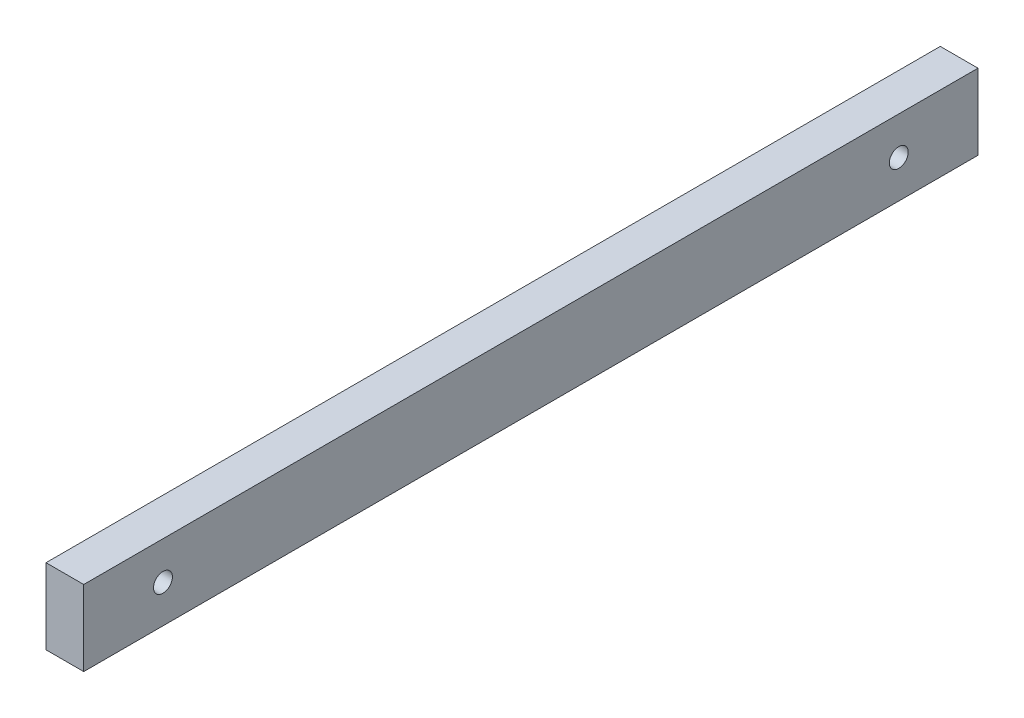
ISO-10303-21;
HEADER;
FILE_DESCRIPTION(('STEP AP214'),'2;1');
FILE_NAME('part.step','',(''),(''),'','','');
FILE_SCHEMA(('AUTOMOTIVE_DESIGN { 1 0 10303 214 1 1 1 1 }'));
ENDSEC;
DATA;
#1=APPLICATION_CONTEXT('core data for automotive mechanical design processes');
#2=APPLICATION_PROTOCOL_DEFINITION('international standard','automotive_design',2000,#1);
#3=PRODUCT_CONTEXT('',#1,'mechanical');
#4=PRODUCT('Part','Part','',(#3));
#5=PRODUCT_RELATED_PRODUCT_CATEGORY('part','',(#4));
#6=PRODUCT_DEFINITION_FORMATION('','',#4);
#7=PRODUCT_DEFINITION_CONTEXT('part definition',#1,'design');
#8=PRODUCT_DEFINITION('design','',#6,#7);
#9=PRODUCT_DEFINITION_SHAPE('','',#8);
#10=(LENGTH_UNIT() NAMED_UNIT(*) SI_UNIT(.MILLI.,.METRE.));
#11=(NAMED_UNIT(*) PLANE_ANGLE_UNIT() SI_UNIT($,.RADIAN.));
#12=(NAMED_UNIT(*) SI_UNIT($,.STERADIAN.) SOLID_ANGLE_UNIT());
#13=UNCERTAINTY_MEASURE_WITH_UNIT(LENGTH_MEASURE(1.E-05),#10,'distance_accuracy_value','');
#14=(GEOMETRIC_REPRESENTATION_CONTEXT(3) GLOBAL_UNCERTAINTY_ASSIGNED_CONTEXT((#13)) GLOBAL_UNIT_ASSIGNED_CONTEXT((#10,
#11,#12)) REPRESENTATION_CONTEXT('',''));
#15=CARTESIAN_POINT('',(0.,0.,0.));
#16=DIRECTION('',(0.,0.,1.));
#17=DIRECTION('',(1.,0.,0.));
#18=AXIS2_PLACEMENT_3D('',#15,#16,#17);
#19=CARTESIAN_POINT('',(4.99999999999999,20.,-118.5));
#20=DIRECTION('',(-1.,0.,0.));
#21=DIRECTION('',(0.,0.,1.));
#22=AXIS2_PLACEMENT_3D('',#19,#20,#21);
#23=PLANE('',#22);
#24=CARTESIAN_POINT('',(4.99999999999999,10.0000000000001,-97.5));
#25=DIRECTION('',(1.,0.,0.));
#26=DIRECTION('',(0.,0.,-1.));
#27=AXIS2_PLACEMENT_3D('',#24,#25,#26);
#28=CIRCLE('',#27,2.49999999999999);
#29=CARTESIAN_POINT('',(4.99999999999999,10.0000000000001,-100.));
#30=VERTEX_POINT('',#29);
#31=EDGE_CURVE('E116',#30,#30,#28,.T.);
#32=ORIENTED_EDGE('',*,*,#31,.F.);
#33=EDGE_LOOP('',(#32));
#34=FACE_BOUND('',#33,.T.);
#35=CARTESIAN_POINT('',(5.00000000000001,10.,97.5));
#36=DIRECTION('',(1.,0.,0.));
#37=DIRECTION('',(0.,0.,-1.));
#38=AXIS2_PLACEMENT_3D('',#35,#36,#37);
#39=CIRCLE('',#38,2.49999999999999);
#40=CARTESIAN_POINT('',(5.00000000000001,10.,95.));
#41=VERTEX_POINT('',#40);
#42=EDGE_CURVE('E110',#41,#41,#39,.T.);
#43=ORIENTED_EDGE('',*,*,#42,.F.);
#44=EDGE_LOOP('',(#43));
#45=FACE_BOUND('',#44,.T.);
#46=DIRECTION('',(0.,0.,-1.));
#47=VECTOR('',#46,1.);
#48=CARTESIAN_POINT('',(4.99999999999999,0.,-118.5));
#49=LINE('',#48,#47);
#50=CARTESIAN_POINT('',(5.00000000000001,0.,118.5));
#51=VERTEX_POINT('',#50);
#52=CARTESIAN_POINT('',(4.99999999999999,0.,-118.5));
#53=VERTEX_POINT('',#52);
#54=EDGE_CURVE('E96',#51,#53,#49,.T.);
#55=ORIENTED_EDGE('',*,*,#54,.T.);
#56=DIRECTION('',(0.,-1.,0.));
#57=VECTOR('',#56,1.);
#58=CARTESIAN_POINT('',(4.99999999999999,20.,-118.5));
#59=LINE('',#58,#57);
#60=CARTESIAN_POINT('',(4.99999999999999,20.,-118.5));
#61=VERTEX_POINT('',#60);
#62=EDGE_CURVE('E11',#61,#53,#59,.T.);
#63=ORIENTED_EDGE('',*,*,#62,.F.);
#64=DIRECTION('',(0.,0.,-1.));
#65=VECTOR('',#64,1.);
#66=CARTESIAN_POINT('',(4.99999999999999,20.,-118.5));
#67=LINE('',#66,#65);
#68=CARTESIAN_POINT('',(5.00000000000001,20.,118.5));
#69=VERTEX_POINT('',#68);
#70=EDGE_CURVE('E84',#69,#61,#67,.T.);
#71=ORIENTED_EDGE('',*,*,#70,.F.);
#72=DIRECTION('',(0.,-1.,0.));
#73=VECTOR('',#72,1.);
#74=CARTESIAN_POINT('',(5.00000000000001,20.,118.5));
#75=LINE('',#74,#73);
#76=EDGE_CURVE('E92',#69,#51,#75,.T.);
#77=ORIENTED_EDGE('',*,*,#76,.T.);
#78=EDGE_LOOP('',(#55,#63,#71,#77));
#79=FACE_BOUND('',#78,.T.);
#80=ADVANCED_FACE('F33',(#34,#45,#79),#23,.F.);
#81=CARTESIAN_POINT('',(-5.00000000000002,20.,-118.5));
#82=DIRECTION('',(0.,0.,1.));
#83=DIRECTION('',(1.,0.,0.));
#84=AXIS2_PLACEMENT_3D('',#81,#82,#83);
#85=PLANE('',#84);
#86=DIRECTION('',(-1.,0.,0.));
#87=VECTOR('',#86,1.);
#88=CARTESIAN_POINT('',(-5.00000000000002,0.,-118.5));
#89=LINE('',#88,#87);
#90=CARTESIAN_POINT('',(-5.00000000000002,0.,-118.5));
#91=VERTEX_POINT('',#90);
#92=EDGE_CURVE('E88',#53,#91,#89,.T.);
#93=ORIENTED_EDGE('',*,*,#92,.T.);
#94=DIRECTION('',(0.,-1.,0.));
#95=VECTOR('',#94,1.);
#96=CARTESIAN_POINT('',(-5.00000000000002,20.,-118.5));
#97=LINE('',#96,#95);
#98=CARTESIAN_POINT('',(-5.00000000000002,20.,-118.5));
#99=VERTEX_POINT('',#98);
#100=EDGE_CURVE('E41',#99,#91,#97,.T.);
#101=ORIENTED_EDGE('',*,*,#100,.F.);
#102=DIRECTION('',(-1.,0.,0.));
#103=VECTOR('',#102,1.);
#104=CARTESIAN_POINT('',(-5.00000000000002,20.,-118.5));
#105=LINE('',#104,#103);
#106=EDGE_CURVE('E79',#61,#99,#105,.T.);
#107=ORIENTED_EDGE('',*,*,#106,.F.);
#108=ORIENTED_EDGE('',*,*,#62,.T.);
#109=EDGE_LOOP('',(#93,#101,#107,#108));
#110=FACE_BOUND('',#109,.T.);
#111=ADVANCED_FACE('F87',(#110),#85,.F.);
#112=CARTESIAN_POINT('',(-5.00000000000002,20.,-118.5));
#113=DIRECTION('',(1.,0.,0.));
#114=DIRECTION('',(0.,0.,-1.));
#115=AXIS2_PLACEMENT_3D('',#112,#113,#114);
#116=PLANE('',#115);
#117=CARTESIAN_POINT('',(-5.00000000000001,10.0000000000001,-97.5));
#118=DIRECTION('',(1.,0.,0.));
#119=DIRECTION('',(0.,0.,-1.));
#120=AXIS2_PLACEMENT_3D('',#117,#118,#119);
#121=CIRCLE('',#120,2.49999999999999);
#122=CARTESIAN_POINT('',(-5.00000000000001,10.0000000000001,-100.));
#123=VERTEX_POINT('',#122);
#124=EDGE_CURVE('E113',#123,#123,#121,.T.);
#125=ORIENTED_EDGE('',*,*,#124,.T.);
#126=EDGE_LOOP('',(#125));
#127=FACE_BOUND('',#126,.T.);
#128=CARTESIAN_POINT('',(-4.99999999999999,10.,97.5));
#129=DIRECTION('',(1.,0.,0.));
#130=DIRECTION('',(0.,0.,-1.));
#131=AXIS2_PLACEMENT_3D('',#128,#129,#130);
#132=CIRCLE('',#131,2.49999999999999);
#133=CARTESIAN_POINT('',(-4.99999999999999,10.,95.));
#134=VERTEX_POINT('',#133);
#135=EDGE_CURVE('E99',#134,#134,#132,.T.);
#136=ORIENTED_EDGE('',*,*,#135,.T.);
#137=EDGE_LOOP('',(#136));
#138=FACE_BOUND('',#137,.T.);
#139=DIRECTION('',(0.,0.,1.));
#140=VECTOR('',#139,1.);
#141=CARTESIAN_POINT('',(-5.00000000000002,0.,-118.5));
#142=LINE('',#141,#140);
#143=CARTESIAN_POINT('',(-4.99999999999999,0.,118.5));
#144=VERTEX_POINT('',#143);
#145=EDGE_CURVE('E66',#91,#144,#142,.T.);
#146=ORIENTED_EDGE('',*,*,#145,.T.);
#147=DIRECTION('',(0.,-1.,0.));
#148=VECTOR('',#147,1.);
#149=CARTESIAN_POINT('',(-4.99999999999999,20.,118.5));
#150=LINE('',#149,#148);
#151=CARTESIAN_POINT('',(-4.99999999999999,20.,118.5));
#152=VERTEX_POINT('',#151);
#153=EDGE_CURVE('E89',#152,#144,#150,.T.);
#154=ORIENTED_EDGE('',*,*,#153,.F.);
#155=DIRECTION('',(0.,0.,1.));
#156=VECTOR('',#155,1.);
#157=CARTESIAN_POINT('',(-5.00000000000002,20.,-118.5));
#158=LINE('',#157,#156);
#159=EDGE_CURVE('E82',#99,#152,#158,.T.);
#160=ORIENTED_EDGE('',*,*,#159,.F.);
#161=ORIENTED_EDGE('',*,*,#100,.T.);
#162=EDGE_LOOP('',(#146,#154,#160,#161));
#163=FACE_BOUND('',#162,.T.);
#164=ADVANCED_FACE('F90',(#127,#138,#163),#116,.F.);
#165=CARTESIAN_POINT('',(-4.99999999999999,20.,118.5));
#166=DIRECTION('',(0.,0.,-1.));
#167=DIRECTION('',(-1.,0.,0.));
#168=AXIS2_PLACEMENT_3D('',#165,#166,#167);
#169=PLANE('',#168);
#170=DIRECTION('',(1.,0.,0.));
#171=VECTOR('',#170,1.);
#172=CARTESIAN_POINT('',(-4.99999999999999,0.,118.5));
#173=LINE('',#172,#171);
#174=EDGE_CURVE('E72',#144,#51,#173,.T.);
#175=ORIENTED_EDGE('',*,*,#174,.T.);
#176=ORIENTED_EDGE('',*,*,#76,.F.);
#177=DIRECTION('',(1.,0.,0.));
#178=VECTOR('',#177,1.);
#179=CARTESIAN_POINT('',(-4.99999999999999,20.,118.5));
#180=LINE('',#179,#178);
#181=EDGE_CURVE('E49',#152,#69,#180,.T.);
#182=ORIENTED_EDGE('',*,*,#181,.F.);
#183=ORIENTED_EDGE('',*,*,#153,.T.);
#184=EDGE_LOOP('',(#175,#176,#182,#183));
#185=FACE_BOUND('',#184,.T.);
#186=ADVANCED_FACE('F104',(#185),#169,.F.);
#187=CARTESIAN_POINT('',(0.,20.,0.));
#188=DIRECTION('',(0.,1.,0.));
#189=DIRECTION('',(0.,0.,1.));
#190=AXIS2_PLACEMENT_3D('',#187,#188,#189);
#191=PLANE('',#190);
#192=ORIENTED_EDGE('',*,*,#70,.T.);
#193=ORIENTED_EDGE('',*,*,#106,.T.);
#194=ORIENTED_EDGE('',*,*,#159,.T.);
#195=ORIENTED_EDGE('',*,*,#181,.T.);
#196=EDGE_LOOP('',(#192,#193,#194,#195));
#197=FACE_BOUND('',#196,.T.);
#198=ADVANCED_FACE('F80',(#197),#191,.T.);
#199=CARTESIAN_POINT('',(0.,0.,0.));
#200=DIRECTION('',(0.,1.,0.));
#201=DIRECTION('',(0.,0.,1.));
#202=AXIS2_PLACEMENT_3D('',#199,#200,#201);
#203=PLANE('',#202);
#204=ORIENTED_EDGE('',*,*,#54,.F.);
#205=ORIENTED_EDGE('',*,*,#174,.F.);
#206=ORIENTED_EDGE('',*,*,#145,.F.);
#207=ORIENTED_EDGE('',*,*,#92,.F.);
#208=EDGE_LOOP('',(#204,#205,#206,#207));
#209=FACE_BOUND('',#208,.T.);
#210=ADVANCED_FACE('F107',(#209),#203,.F.);
#211=CARTESIAN_POINT('',(-4.99999999999999,10.,97.5));
#212=DIRECTION('',(1.,0.,0.));
#213=DIRECTION('',(0.,0.,-1.));
#214=AXIS2_PLACEMENT_3D('',#211,#212,#213);
#215=CYLINDRICAL_SURFACE('',#214,2.49999999999999);
#216=ORIENTED_EDGE('',*,*,#135,.F.);
#217=EDGE_LOOP('',(#216));
#218=FACE_BOUND('',#217,.T.);
#219=ORIENTED_EDGE('',*,*,#42,.T.);
#220=EDGE_LOOP('',(#219));
#221=FACE_BOUND('',#220,.T.);
#222=ADVANCED_FACE('F127',(#218,#221),#215,.F.);
#223=CARTESIAN_POINT('',(-5.00000000000001,10.0000000000001,-97.5));
#224=DIRECTION('',(1.,0.,0.));
#225=DIRECTION('',(0.,0.,-1.));
#226=AXIS2_PLACEMENT_3D('',#223,#224,#225);
#227=CYLINDRICAL_SURFACE('',#226,2.49999999999999);
#228=ORIENTED_EDGE('',*,*,#124,.F.);
#229=EDGE_LOOP('',(#228));
#230=FACE_BOUND('',#229,.T.);
#231=ORIENTED_EDGE('',*,*,#31,.T.);
#232=EDGE_LOOP('',(#231));
#233=FACE_BOUND('',#232,.T.);
#234=ADVANCED_FACE('F124',(#230,#233),#227,.F.);
#235=CLOSED_SHELL('',(#80,#111,#164,#186,#198,#210,#222,#234));
#236=MANIFOLD_SOLID_BREP('B2',#235);
#237=ADVANCED_BREP_SHAPE_REPRESENTATION('',(#18,#236),#14);
#238=SHAPE_DEFINITION_REPRESENTATION(#9,#237);
ENDSEC;
END-ISO-10303-21;
